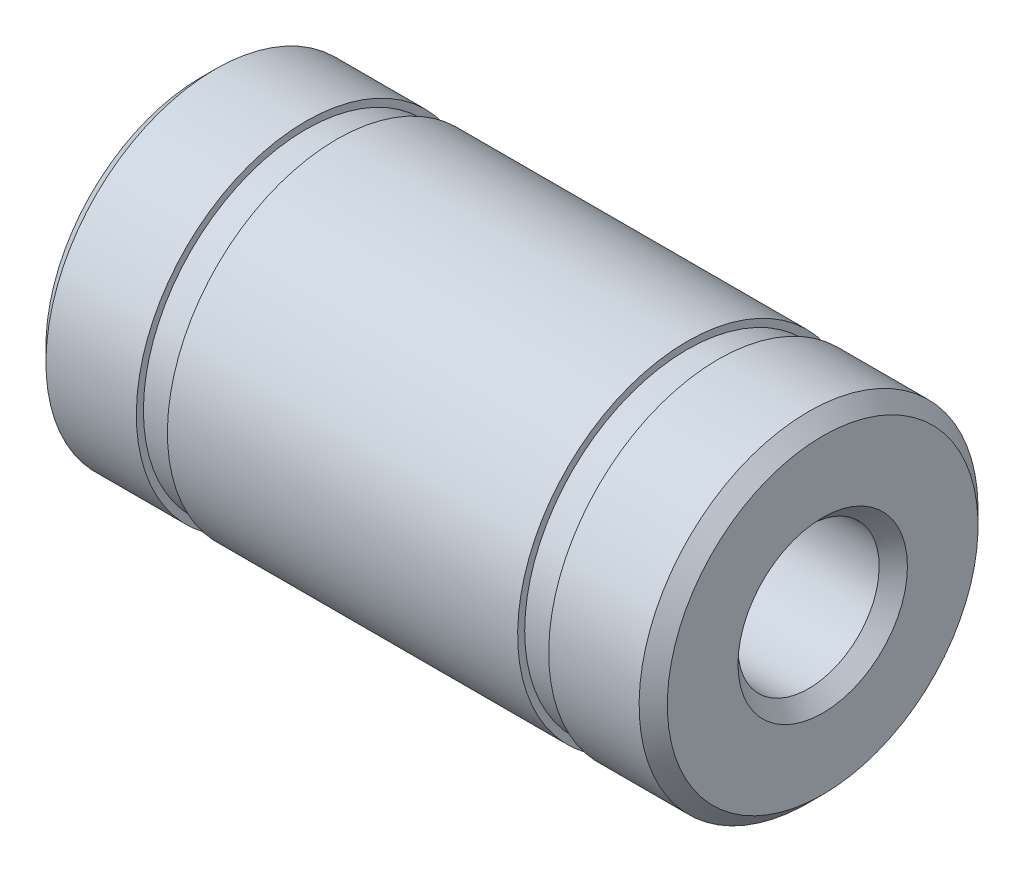
ISO-10303-21;
HEADER;
FILE_DESCRIPTION(('STEP AP214'),'2;1');
FILE_NAME('part.step','',(''),(''),'','','');
FILE_SCHEMA(('AUTOMOTIVE_DESIGN { 1 0 10303 214 1 1 1 1 }'));
ENDSEC;
DATA;
#1=APPLICATION_CONTEXT('core data for automotive mechanical design processes');
#2=APPLICATION_PROTOCOL_DEFINITION('international standard','automotive_design',2000,#1);
#3=PRODUCT_CONTEXT('',#1,'mechanical');
#4=PRODUCT('Part','Part','',(#3));
#5=PRODUCT_RELATED_PRODUCT_CATEGORY('part','',(#4));
#6=PRODUCT_DEFINITION_FORMATION('','',#4);
#7=PRODUCT_DEFINITION_CONTEXT('part definition',#1,'design');
#8=PRODUCT_DEFINITION('design','',#6,#7);
#9=PRODUCT_DEFINITION_SHAPE('','',#8);
#10=(LENGTH_UNIT() NAMED_UNIT(*) SI_UNIT(.MILLI.,.METRE.));
#11=(NAMED_UNIT(*) PLANE_ANGLE_UNIT() SI_UNIT($,.RADIAN.));
#12=(NAMED_UNIT(*) SI_UNIT($,.STERADIAN.) SOLID_ANGLE_UNIT());
#13=UNCERTAINTY_MEASURE_WITH_UNIT(LENGTH_MEASURE(1.E-05),#10,'distance_accuracy_value','');
#14=(GEOMETRIC_REPRESENTATION_CONTEXT(3) GLOBAL_UNCERTAINTY_ASSIGNED_CONTEXT((#13)) GLOBAL_UNIT_ASSIGNED_CONTEXT((#10,
#11,#12)) REPRESENTATION_CONTEXT('',''));
#15=CARTESIAN_POINT('',(0.,0.,0.));
#16=DIRECTION('',(0.,0.,1.));
#17=DIRECTION('',(1.,0.,0.));
#18=AXIS2_PLACEMENT_3D('',#15,#16,#17);
#19=CARTESIAN_POINT('',(18.3,6.,0.));
#20=DIRECTION('',(-1.,0.,0.));
#21=DIRECTION('',(0.,0.,1.));
#22=AXIS2_PLACEMENT_3D('',#19,#20,#21);
#23=PLANE('',#22);
#24=CARTESIAN_POINT('',(18.3,0.,0.));
#25=DIRECTION('',(1.,0.,0.));
#26=DIRECTION('',(0.,0.,-1.));
#27=AXIS2_PLACEMENT_3D('',#24,#25,#26);
#28=CIRCLE('',#27,6.);
#29=CARTESIAN_POINT('',(18.3,6.,0.));
#30=VERTEX_POINT('',#29);
#31=EDGE_CURVE('E132',#30,#30,#28,.T.);
#32=ORIENTED_EDGE('',*,*,#31,.F.);
#33=EDGE_LOOP('',(#32));
#34=FACE_BOUND('',#33,.T.);
#35=CARTESIAN_POINT('',(18.3,0.,0.));
#36=DIRECTION('',(1.,0.,0.));
#37=DIRECTION('',(0.,0.,-1.));
#38=AXIS2_PLACEMENT_3D('',#35,#36,#37);
#39=CIRCLE('',#38,5.75);
#40=CARTESIAN_POINT('',(18.3,5.75,0.));
#41=VERTEX_POINT('',#40);
#42=EDGE_CURVE('E11',#41,#41,#39,.T.);
#43=ORIENTED_EDGE('',*,*,#42,.T.);
#44=EDGE_LOOP('',(#43));
#45=FACE_BOUND('',#44,.T.);
#46=ADVANCED_FACE('F17',(#34,#45),#23,.T.);
#47=CARTESIAN_POINT('',(17.75,0.,0.));
#48=DIRECTION('',(1.,0.,0.));
#49=DIRECTION('',(0.,1.,0.));
#50=AXIS2_PLACEMENT_3D('',#47,#48,#49);
#51=CYLINDRICAL_SURFACE('',#50,5.75);
#52=ORIENTED_EDGE('',*,*,#42,.F.);
#53=EDGE_LOOP('',(#52));
#54=FACE_BOUND('',#53,.T.);
#55=CARTESIAN_POINT('',(17.2,0.,0.));
#56=DIRECTION('',(1.,0.,0.));
#57=DIRECTION('',(0.,0.,-1.));
#58=AXIS2_PLACEMENT_3D('',#55,#56,#57);
#59=CIRCLE('',#58,5.75);
#60=CARTESIAN_POINT('',(17.2,5.75,0.));
#61=VERTEX_POINT('',#60);
#62=EDGE_CURVE('E28',#61,#61,#59,.T.);
#63=ORIENTED_EDGE('',*,*,#62,.T.);
#64=EDGE_LOOP('',(#63));
#65=FACE_BOUND('',#64,.T.);
#66=ADVANCED_FACE('F182',(#54,#65),#51,.T.);
#67=CARTESIAN_POINT('',(17.2,5.75,0.));
#68=DIRECTION('',(1.,0.,0.));
#69=DIRECTION('',(0.,1.,0.));
#70=AXIS2_PLACEMENT_3D('',#67,#68,#69);
#71=PLANE('',#70);
#72=ORIENTED_EDGE('',*,*,#62,.F.);
#73=EDGE_LOOP('',(#72));
#74=FACE_BOUND('',#73,.T.);
#75=CARTESIAN_POINT('',(17.2,0.,0.));
#76=DIRECTION('',(1.,0.,0.));
#77=DIRECTION('',(0.,0.,-1.));
#78=AXIS2_PLACEMENT_3D('',#75,#76,#77);
#79=CIRCLE('',#78,6.);
#80=CARTESIAN_POINT('',(17.2,6.,0.));
#81=VERTEX_POINT('',#80);
#82=EDGE_CURVE('E137',#81,#81,#79,.T.);
#83=ORIENTED_EDGE('',*,*,#82,.T.);
#84=EDGE_LOOP('',(#83));
#85=FACE_BOUND('',#84,.T.);
#86=ADVANCED_FACE('F188',(#74,#85),#71,.T.);
#87=CARTESIAN_POINT('',(11.,0.,0.));
#88=DIRECTION('',(1.,0.,0.));
#89=DIRECTION('',(0.,1.,0.));
#90=AXIS2_PLACEMENT_3D('',#87,#88,#89);
#91=CYLINDRICAL_SURFACE('',#90,6.);
#92=ORIENTED_EDGE('',*,*,#82,.F.);
#93=EDGE_LOOP('',(#92));
#94=FACE_BOUND('',#93,.T.);
#95=CARTESIAN_POINT('',(4.8,0.,0.));
#96=DIRECTION('',(1.,0.,0.));
#97=DIRECTION('',(0.,0.,-1.));
#98=AXIS2_PLACEMENT_3D('',#95,#96,#97);
#99=CIRCLE('',#98,6.);
#100=CARTESIAN_POINT('',(4.8,6.,0.));
#101=VERTEX_POINT('',#100);
#102=EDGE_CURVE('E91',#101,#101,#99,.T.);
#103=ORIENTED_EDGE('',*,*,#102,.T.);
#104=EDGE_LOOP('',(#103));
#105=FACE_BOUND('',#104,.T.);
#106=ADVANCED_FACE('F200',(#94,#105),#91,.T.);
#107=CARTESIAN_POINT('',(4.8,6.,0.));
#108=DIRECTION('',(-1.,0.,0.));
#109=DIRECTION('',(0.,0.,1.));
#110=AXIS2_PLACEMENT_3D('',#107,#108,#109);
#111=PLANE('',#110);
#112=ORIENTED_EDGE('',*,*,#102,.F.);
#113=EDGE_LOOP('',(#112));
#114=FACE_BOUND('',#113,.T.);
#115=CARTESIAN_POINT('',(4.8,0.,0.));
#116=DIRECTION('',(1.,0.,0.));
#117=DIRECTION('',(0.,0.,-1.));
#118=AXIS2_PLACEMENT_3D('',#115,#116,#117);
#119=CIRCLE('',#118,5.75);
#120=CARTESIAN_POINT('',(4.8,5.75,0.));
#121=VERTEX_POINT('',#120);
#122=EDGE_CURVE('E102',#121,#121,#119,.T.);
#123=ORIENTED_EDGE('',*,*,#122,.T.);
#124=EDGE_LOOP('',(#123));
#125=FACE_BOUND('',#124,.T.);
#126=ADVANCED_FACE('F197',(#114,#125),#111,.T.);
#127=CARTESIAN_POINT('',(4.25,0.,0.));
#128=DIRECTION('',(1.,0.,0.));
#129=DIRECTION('',(0.,1.,0.));
#130=AXIS2_PLACEMENT_3D('',#127,#128,#129);
#131=CYLINDRICAL_SURFACE('',#130,5.75);
#132=ORIENTED_EDGE('',*,*,#122,.F.);
#133=EDGE_LOOP('',(#132));
#134=FACE_BOUND('',#133,.T.);
#135=CARTESIAN_POINT('',(3.7,0.,0.));
#136=DIRECTION('',(1.,0.,0.));
#137=DIRECTION('',(0.,0.,-1.));
#138=AXIS2_PLACEMENT_3D('',#135,#136,#137);
#139=CIRCLE('',#138,5.75);
#140=CARTESIAN_POINT('',(3.7,5.75,0.));
#141=VERTEX_POINT('',#140);
#142=EDGE_CURVE('E135',#141,#141,#139,.T.);
#143=ORIENTED_EDGE('',*,*,#142,.T.);
#144=EDGE_LOOP('',(#143));
#145=FACE_BOUND('',#144,.T.);
#146=ADVANCED_FACE('F158',(#134,#145),#131,.T.);
#147=CARTESIAN_POINT('',(3.7,5.75,0.));
#148=DIRECTION('',(1.,0.,0.));
#149=DIRECTION('',(0.,1.,0.));
#150=AXIS2_PLACEMENT_3D('',#147,#148,#149);
#151=PLANE('',#150);
#152=ORIENTED_EDGE('',*,*,#142,.F.);
#153=EDGE_LOOP('',(#152));
#154=FACE_BOUND('',#153,.T.);
#155=CARTESIAN_POINT('',(3.7,0.,0.));
#156=DIRECTION('',(1.,0.,0.));
#157=DIRECTION('',(0.,0.,-1.));
#158=AXIS2_PLACEMENT_3D('',#155,#156,#157);
#159=CIRCLE('',#158,6.);
#160=CARTESIAN_POINT('',(3.7,6.,0.));
#161=VERTEX_POINT('',#160);
#162=EDGE_CURVE('E117',#161,#161,#159,.T.);
#163=ORIENTED_EDGE('',*,*,#162,.T.);
#164=EDGE_LOOP('',(#163));
#165=FACE_BOUND('',#164,.T.);
#166=ADVANCED_FACE('F160',(#154,#165),#151,.T.);
#167=CARTESIAN_POINT('',(20.15,0.,0.));
#168=DIRECTION('',(1.,0.,0.));
#169=DIRECTION('',(0.,1.,0.));
#170=AXIS2_PLACEMENT_3D('',#167,#168,#169);
#171=CYLINDRICAL_SURFACE('',#170,6.);
#172=CARTESIAN_POINT('',(21.5,0.,0.));
#173=DIRECTION('',(1.,0.,0.));
#174=DIRECTION('',(0.,-1.,0.));
#175=AXIS2_PLACEMENT_3D('',#172,#173,#174);
#176=CIRCLE('',#175,6.);
#177=CARTESIAN_POINT('',(21.5,6.,0.));
#178=VERTEX_POINT('',#177);
#179=EDGE_CURVE('E124',#178,#178,#176,.T.);
#180=ORIENTED_EDGE('',*,*,#179,.F.);
#181=EDGE_LOOP('',(#180));
#182=FACE_BOUND('',#181,.T.);
#183=ORIENTED_EDGE('',*,*,#31,.T.);
#184=EDGE_LOOP('',(#183));
#185=FACE_BOUND('',#184,.T.);
#186=ADVANCED_FACE('F163',(#182,#185),#171,.T.);
#187=CARTESIAN_POINT('',(21.75,0.,0.));
#188=DIRECTION('',(-1.,0.,0.));
#189=DIRECTION('',(0.,-1.,0.));
#190=AXIS2_PLACEMENT_3D('',#187,#188,#189);
#191=CONICAL_SURFACE('',#190,5.75,0.785398163400002);
#192=CARTESIAN_POINT('',(22.,0.,0.));
#193=DIRECTION('',(-1.,0.,0.));
#194=DIRECTION('',(0.,-1.,0.));
#195=AXIS2_PLACEMENT_3D('',#192,#193,#194);
#196=CIRCLE('',#195,5.5);
#197=CARTESIAN_POINT('',(22.,5.5,0.));
#198=VERTEX_POINT('',#197);
#199=EDGE_CURVE('E21',#198,#198,#196,.T.);
#200=ORIENTED_EDGE('',*,*,#199,.T.);
#201=EDGE_LOOP('',(#200));
#202=FACE_BOUND('',#201,.T.);
#203=ORIENTED_EDGE('',*,*,#179,.T.);
#204=EDGE_LOOP('',(#203));
#205=FACE_BOUND('',#204,.T.);
#206=ADVANCED_FACE('F169',(#202,#205),#191,.T.);
#207=CARTESIAN_POINT('',(1.85,0.,0.));
#208=DIRECTION('',(1.,0.,0.));
#209=DIRECTION('',(0.,1.,0.));
#210=AXIS2_PLACEMENT_3D('',#207,#208,#209);
#211=CYLINDRICAL_SURFACE('',#210,6.);
#212=CARTESIAN_POINT('',(0.5,0.,0.));
#213=DIRECTION('',(-1.,0.,0.));
#214=DIRECTION('',(0.,-1.,0.));
#215=AXIS2_PLACEMENT_3D('',#212,#213,#214);
#216=CIRCLE('',#215,6.);
#217=CARTESIAN_POINT('',(0.5,6.,0.));
#218=VERTEX_POINT('',#217);
#219=EDGE_CURVE('E112',#218,#218,#216,.T.);
#220=ORIENTED_EDGE('',*,*,#219,.F.);
#221=EDGE_LOOP('',(#220));
#222=FACE_BOUND('',#221,.T.);
#223=ORIENTED_EDGE('',*,*,#162,.F.);
#224=EDGE_LOOP('',(#223));
#225=FACE_BOUND('',#224,.T.);
#226=ADVANCED_FACE('F167',(#222,#225),#211,.T.);
#227=CARTESIAN_POINT('',(0.25,0.,0.));
#228=DIRECTION('',(1.,0.,0.));
#229=DIRECTION('',(0.,-1.,0.));
#230=AXIS2_PLACEMENT_3D('',#227,#228,#229);
#231=CONICAL_SURFACE('',#230,5.75,0.785398163400002);
#232=ORIENTED_EDGE('',*,*,#219,.T.);
#233=EDGE_LOOP('',(#232));
#234=FACE_BOUND('',#233,.T.);
#235=CARTESIAN_POINT('',(0.,0.,0.));
#236=DIRECTION('',(1.,0.,0.));
#237=DIRECTION('',(0.,-1.,0.));
#238=AXIS2_PLACEMENT_3D('',#235,#236,#237);
#239=CIRCLE('',#238,5.5);
#240=CARTESIAN_POINT('',(0.,5.5,0.));
#241=VERTEX_POINT('',#240);
#242=EDGE_CURVE('E331',#241,#241,#239,.T.);
#243=ORIENTED_EDGE('',*,*,#242,.T.);
#244=EDGE_LOOP('',(#243));
#245=FACE_BOUND('',#244,.T.);
#246=ADVANCED_FACE('F113',(#234,#245),#231,.T.);
#247=CARTESIAN_POINT('',(22.,2.5,0.));
#248=DIRECTION('',(1.,0.,0.));
#249=DIRECTION('',(0.,1.,0.));
#250=AXIS2_PLACEMENT_3D('',#247,#248,#249);
#251=PLANE('',#250);
#252=CARTESIAN_POINT('',(22.,0.,0.));
#253=DIRECTION('',(1.,0.,0.));
#254=DIRECTION('',(0.,-1.,0.));
#255=AXIS2_PLACEMENT_3D('',#252,#253,#254);
#256=CIRCLE('',#255,3.);
#257=CARTESIAN_POINT('',(22.,3.,0.));
#258=VERTEX_POINT('',#257);
#259=EDGE_CURVE('E126',#258,#258,#256,.T.);
#260=ORIENTED_EDGE('',*,*,#259,.F.);
#261=EDGE_LOOP('',(#260));
#262=FACE_BOUND('',#261,.T.);
#263=ORIENTED_EDGE('',*,*,#199,.F.);
#264=EDGE_LOOP('',(#263));
#265=FACE_BOUND('',#264,.T.);
#266=ADVANCED_FACE('F176',(#262,#265),#251,.T.);
#267=CARTESIAN_POINT('',(21.75,0.,0.));
#268=DIRECTION('',(1.,0.,0.));
#269=DIRECTION('',(0.,-1.,0.));
#270=AXIS2_PLACEMENT_3D('',#267,#268,#269);
#271=CONICAL_SURFACE('',#270,2.75,0.785398163400002);
#272=CARTESIAN_POINT('',(21.5,0.,0.));
#273=DIRECTION('',(-1.,0.,0.));
#274=DIRECTION('',(0.,-1.,0.));
#275=AXIS2_PLACEMENT_3D('',#272,#273,#274);
#276=CIRCLE('',#275,2.5);
#277=CARTESIAN_POINT('',(21.5,2.5,0.));
#278=VERTEX_POINT('',#277);
#279=EDGE_CURVE('E129',#278,#278,#276,.T.);
#280=ORIENTED_EDGE('',*,*,#279,.T.);
#281=EDGE_LOOP('',(#280));
#282=FACE_BOUND('',#281,.T.);
#283=ORIENTED_EDGE('',*,*,#259,.T.);
#284=EDGE_LOOP('',(#283));
#285=FACE_BOUND('',#284,.T.);
#286=ADVANCED_FACE('F195',(#282,#285),#271,.F.);
#287=CARTESIAN_POINT('',(0.,6.,0.));
#288=DIRECTION('',(-1.,0.,0.));
#289=DIRECTION('',(0.,0.,1.));
#290=AXIS2_PLACEMENT_3D('',#287,#288,#289);
#291=PLANE('',#290);
#292=CARTESIAN_POINT('',(0.,0.,0.));
#293=DIRECTION('',(-1.,0.,0.));
#294=DIRECTION('',(0.,-1.,0.));
#295=AXIS2_PLACEMENT_3D('',#292,#293,#294);
#296=CIRCLE('',#295,3.);
#297=CARTESIAN_POINT('',(0.,3.,0.));
#298=VERTEX_POINT('',#297);
#299=EDGE_CURVE('E60',#298,#298,#296,.T.);
#300=ORIENTED_EDGE('',*,*,#299,.F.);
#301=EDGE_LOOP('',(#300));
#302=FACE_BOUND('',#301,.T.);
#303=ORIENTED_EDGE('',*,*,#242,.F.);
#304=EDGE_LOOP('',(#303));
#305=FACE_BOUND('',#304,.T.);
#306=ADVANCED_FACE('F206',(#302,#305),#291,.T.);
#307=CARTESIAN_POINT('',(11.,0.,0.));
#308=DIRECTION('',(1.,0.,0.));
#309=DIRECTION('',(0.,1.,0.));
#310=AXIS2_PLACEMENT_3D('',#307,#308,#309);
#311=CYLINDRICAL_SURFACE('',#310,2.5);
#312=CARTESIAN_POINT('',(0.5,0.,0.));
#313=DIRECTION('',(1.,0.,0.));
#314=DIRECTION('',(0.,-1.,0.));
#315=AXIS2_PLACEMENT_3D('',#312,#313,#314);
#316=CIRCLE('',#315,2.5);
#317=CARTESIAN_POINT('',(0.5,2.5,0.));
#318=VERTEX_POINT('',#317);
#319=EDGE_CURVE('E70',#318,#318,#316,.T.);
#320=ORIENTED_EDGE('',*,*,#319,.F.);
#321=EDGE_LOOP('',(#320));
#322=FACE_BOUND('',#321,.T.);
#323=ORIENTED_EDGE('',*,*,#279,.F.);
#324=EDGE_LOOP('',(#323));
#325=FACE_BOUND('',#324,.T.);
#326=ADVANCED_FACE('F209',(#322,#325),#311,.F.);
#327=CARTESIAN_POINT('',(0.25,0.,0.));
#328=DIRECTION('',(-1.,0.,0.));
#329=DIRECTION('',(0.,-1.,0.));
#330=AXIS2_PLACEMENT_3D('',#327,#328,#329);
#331=CONICAL_SURFACE('',#330,2.75,0.7853981634);
#332=ORIENTED_EDGE('',*,*,#299,.T.);
#333=EDGE_LOOP('',(#332));
#334=FACE_BOUND('',#333,.T.);
#335=ORIENTED_EDGE('',*,*,#319,.T.);
#336=EDGE_LOOP('',(#335));
#337=FACE_BOUND('',#336,.T.);
#338=ADVANCED_FACE('F19',(#334,#337),#331,.F.);
#339=CLOSED_SHELL('',(#46,#66,#86,#106,#126,#146,#166,#186,#206,#226,#246,#266,#286,#306,#326,#338));
#340=MANIFOLD_SOLID_BREP('B1',#339);
#341=ADVANCED_BREP_SHAPE_REPRESENTATION('',(#18,#340),#14);
#342=SHAPE_DEFINITION_REPRESENTATION(#9,#341);
ENDSEC;
END-ISO-10303-21;
